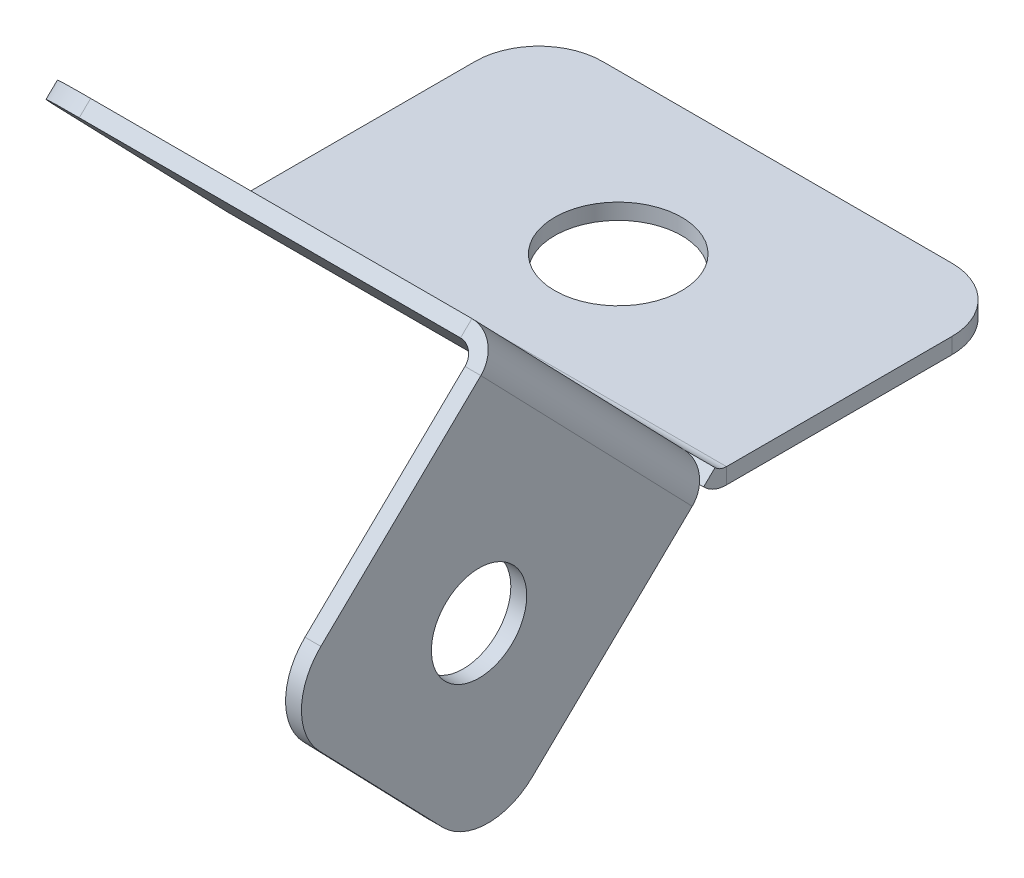
ISO-10303-21;
HEADER;
FILE_DESCRIPTION(('STEP AP214'),'2;1');
FILE_NAME('part.step','',(''),(''),'','','');
FILE_SCHEMA(('AUTOMOTIVE_DESIGN { 1 0 10303 214 1 1 1 1 }'));
ENDSEC;
DATA;
#1=APPLICATION_CONTEXT('core data for automotive mechanical design processes');
#2=APPLICATION_PROTOCOL_DEFINITION('international standard','automotive_design',2000,#1);
#3=PRODUCT_CONTEXT('',#1,'mechanical');
#4=PRODUCT('Part','Part','',(#3));
#5=PRODUCT_RELATED_PRODUCT_CATEGORY('part','',(#4));
#6=PRODUCT_DEFINITION_FORMATION('','',#4);
#7=PRODUCT_DEFINITION_CONTEXT('part definition',#1,'design');
#8=PRODUCT_DEFINITION('design','',#6,#7);
#9=PRODUCT_DEFINITION_SHAPE('','',#8);
#10=(LENGTH_UNIT() NAMED_UNIT(*) SI_UNIT(.MILLI.,.METRE.));
#11=(NAMED_UNIT(*) PLANE_ANGLE_UNIT() SI_UNIT($,.RADIAN.));
#12=(NAMED_UNIT(*) SI_UNIT($,.STERADIAN.) SOLID_ANGLE_UNIT());
#13=UNCERTAINTY_MEASURE_WITH_UNIT(LENGTH_MEASURE(1.E-05),#10,'distance_accuracy_value','');
#14=(GEOMETRIC_REPRESENTATION_CONTEXT(3) GLOBAL_UNCERTAINTY_ASSIGNED_CONTEXT((#13)) GLOBAL_UNIT_ASSIGNED_CONTEXT((#10,
#11,#12)) REPRESENTATION_CONTEXT('',''));
#15=CARTESIAN_POINT('',(0.,0.,0.));
#16=DIRECTION('',(0.,0.,1.));
#17=DIRECTION('',(1.,0.,0.));
#18=AXIS2_PLACEMENT_3D('',#15,#16,#17);
#19=CARTESIAN_POINT('',(6.5,0.305341629540999,4.8120205967255));
#20=DIRECTION('',(0.,0.719339800338647,0.694658370459001));
#21=DIRECTION('',(0.,-0.694658370459001,0.719339800338647));
#22=AXIS2_PLACEMENT_3D('',#19,#20,#21);
#23=PLANE('',#22);
#24=DIRECTION('',(1.,0.,0.));
#25=VECTOR('',#24,1.);
#26=CARTESIAN_POINT('',(-7.5,0.652670814770498,4.45235069655618));
#27=LINE('',#26,#25);
#28=CARTESIAN_POINT('',(6.5,0.652670814770499,4.45235069655618));
#29=VERTEX_POINT('',#28);
#30=CARTESIAN_POINT('',(7.5,0.652670814770501,4.45235069655618));
#31=VERTEX_POINT('',#30);
#32=EDGE_CURVE('E301',#29,#31,#27,.T.);
#33=ORIENTED_EDGE('',*,*,#32,.F.);
#34=CARTESIAN_POINT('',(6.5,-0.0419875556885024,5.17169049689482));
#35=DIRECTION('',(0.,0.719339800338647,0.694658370459001));
#36=DIRECTION('',(0.,-0.694658370459001,0.719339800338647));
#37=AXIS2_PLACEMENT_3D('',#34,#35,#36);
#38=CIRCLE('',#37,1.);
#39=CARTESIAN_POINT('',(7.36602540378444,0.305341629540996,4.8120205967255));
#40=VERTEX_POINT('',#39);
#41=EDGE_CURVE('E267',#29,#40,#38,.F.);
#42=ORIENTED_EDGE('',*,*,#41,.T.);
#43=DIRECTION('',(1.,0.,0.));
#44=VECTOR('',#43,1.);
#45=CARTESIAN_POINT('',(-7.5,0.305341629540998,4.8120205967255));
#46=LINE('',#45,#44);
#47=CARTESIAN_POINT('',(7.5,0.305341629540999,4.8120205967255));
#48=VERTEX_POINT('',#47);
#49=EDGE_CURVE('E290',#48,#40,#46,.F.);
#50=ORIENTED_EDGE('',*,*,#49,.F.);
#51=DIRECTION('',(0.,0.694658370459001,-0.719339800338647));
#52=VECTOR('',#51,1.);
#53=CARTESIAN_POINT('',(7.5,0.652670814770499,4.45235069655618));
#54=LINE('',#53,#52);
#55=EDGE_CURVE('E295',#31,#48,#54,.F.);
#56=ORIENTED_EDGE('',*,*,#55,.F.);
#57=EDGE_LOOP('',(#33,#42,#50,#56));
#58=FACE_BOUND('',#57,.T.);
#59=ADVANCED_FACE('F79',(#58),#23,.T.);
#60=CARTESIAN_POINT('',(0.,-2.60453112695286,2.00198913966243));
#61=DIRECTION('',(0.,0.694658370459001,-0.719339800338647));
#62=DIRECTION('',(0.,0.719339800338647,0.694658370459001));
#63=AXIS2_PLACEMENT_3D('',#60,#61,#62);
#64=PLANE('',#63);
#65=DIRECTION('',(-1.,0.,0.));
#66=VECTOR('',#65,1.);
#67=CARTESIAN_POINT('',(0.,7.19339800338647,11.4637393171865));
#68=LINE('',#67,#66);
#69=CARTESIAN_POINT('',(6.5,7.19339800338648,11.4637393171865));
#70=VERTEX_POINT('',#69);
#71=CARTESIAN_POINT('',(-5.5,7.19339800338647,11.4637393171865));
#72=VERTEX_POINT('',#71);
#73=EDGE_CURVE('E279',#70,#72,#68,.T.);
#74=ORIENTED_EDGE('',*,*,#73,.T.);
#75=CARTESIAN_POINT('',(-5.5,5.75471840270918,10.0744225762685));
#76=DIRECTION('',(0.,0.694658370459001,-0.719339800338647));
#77=DIRECTION('',(0.,0.719339800338647,0.694658370459001));
#78=AXIS2_PLACEMENT_3D('',#75,#76,#77);
#79=CIRCLE('',#78,2.);
#80=CARTESIAN_POINT('',(-7.5,5.75471840270918,10.0744225762685));
#81=VERTEX_POINT('',#80);
#82=EDGE_CURVE('E374',#72,#81,#79,.F.);
#83=ORIENTED_EDGE('',*,*,#82,.T.);
#84=DIRECTION('',(0.,-0.719339800338647,-0.694658370459001));
#85=VECTOR('',#84,1.);
#86=CARTESIAN_POINT('',(-7.5,-2.60453112695286,2.00198913966243));
#87=LINE('',#86,#85);
#88=CARTESIAN_POINT('',(-7.5,0.305341629540997,4.8120205967255));
#89=VERTEX_POINT('',#88);
#90=EDGE_CURVE('E283',#81,#89,#87,.T.);
#91=ORIENTED_EDGE('',*,*,#90,.T.);
#92=CARTESIAN_POINT('',(6.5,0.305341629540998,4.8120205967255));
#93=VERTEX_POINT('',#92);
#94=EDGE_CURVE('E294',#93,#89,#46,.F.);
#95=ORIENTED_EDGE('',*,*,#94,.F.);
#96=DIRECTION('',(0.,0.719339800338647,0.694658370459001));
#97=VECTOR('',#96,1.);
#98=CARTESIAN_POINT('',(6.5,7.19339800338648,11.4637393171865));
#99=LINE('',#98,#97);
#100=EDGE_CURVE('E273',#70,#93,#99,.F.);
#101=ORIENTED_EDGE('',*,*,#100,.F.);
#102=EDGE_LOOP('',(#74,#83,#91,#95,#101));
#103=FACE_BOUND('',#102,.T.);
#104=ADVANCED_FACE('F435',(#103),#64,.F.);
#105=CARTESIAN_POINT('',(0.,-2.25720194172336,1.64231923949311));
#106=DIRECTION('',(0.,0.694658370459001,-0.719339800338647));
#107=DIRECTION('',(0.,0.719339800338647,0.694658370459001));
#108=AXIS2_PLACEMENT_3D('',#105,#106,#107);
#109=PLANE('',#108);
#110=DIRECTION('',(0.,0.719339800338647,0.694658370459001));
#111=VECTOR('',#110,1.);
#112=CARTESIAN_POINT('',(-7.5,0.499999999999999,4.30491820449166));
#113=LINE('',#112,#111);
#114=CARTESIAN_POINT('',(-7.5,6.10204758793868,9.71475267609915));
#115=VERTEX_POINT('',#114);
#116=CARTESIAN_POINT('',(-7.5,0.652670814770498,4.45235069655618));
#117=VERTEX_POINT('',#116);
#118=EDGE_CURVE('E288',#115,#117,#113,.F.);
#119=ORIENTED_EDGE('',*,*,#118,.F.);
#120=CARTESIAN_POINT('',(-5.5,6.10204758793868,9.71475267609915));
#121=DIRECTION('',(0.,0.694658370459001,-0.719339800338647));
#122=DIRECTION('',(0.,0.719339800338647,0.694658370459001));
#123=AXIS2_PLACEMENT_3D('',#120,#121,#122);
#124=CIRCLE('',#123,2.);
#125=CARTESIAN_POINT('',(-5.5,7.54072718861597,11.1040694170171));
#126=VERTEX_POINT('',#125);
#127=EDGE_CURVE('E370',#115,#126,#124,.T.);
#128=ORIENTED_EDGE('',*,*,#127,.T.);
#129=DIRECTION('',(1.,0.,0.));
#130=VECTOR('',#129,1.);
#131=CARTESIAN_POINT('',(-7.5,7.54072718861597,11.1040694170171));
#132=LINE('',#131,#130);
#133=CARTESIAN_POINT('',(6.5,7.54072718861598,11.1040694170172));
#134=VERTEX_POINT('',#133);
#135=EDGE_CURVE('E285',#134,#126,#132,.F.);
#136=ORIENTED_EDGE('',*,*,#135,.F.);
#137=DIRECTION('',(0.,0.719339800338647,0.694658370459001));
#138=VECTOR('',#137,1.);
#139=CARTESIAN_POINT('',(6.5,7.54072718861598,11.1040694170172));
#140=LINE('',#139,#138);
#141=EDGE_CURVE('E218',#134,#29,#140,.F.);
#142=ORIENTED_EDGE('',*,*,#141,.T.);
#143=EDGE_CURVE('E298',#117,#29,#27,.T.);
#144=ORIENTED_EDGE('',*,*,#143,.F.);
#145=EDGE_LOOP('',(#119,#128,#136,#142,#144));
#146=FACE_BOUND('',#145,.T.);
#147=ADVANCED_FACE('F415',(#146),#109,.T.);
#148=CARTESIAN_POINT('',(-7.5,7.19339800338647,11.4637393171865));
#149=DIRECTION('',(0.,-0.719339800338647,-0.694658370459001));
#150=DIRECTION('',(0.,0.694658370459001,-0.719339800338647));
#151=AXIS2_PLACEMENT_3D('',#148,#149,#150);
#152=PLANE('',#151);
#153=ORIENTED_EDGE('',*,*,#135,.T.);
#154=DIRECTION('',(0.,0.694658370459001,-0.719339800338647));
#155=VECTOR('',#154,1.);
#156=CARTESIAN_POINT('',(-5.5,7.19339800338647,11.4637393171865));
#157=LINE('',#156,#155);
#158=EDGE_CURVE('E372',#126,#72,#157,.F.);
#159=ORIENTED_EDGE('',*,*,#158,.T.);
#160=ORIENTED_EDGE('',*,*,#73,.F.);
#161=DIRECTION('',(0.,0.694658370459001,-0.719339800338647));
#162=VECTOR('',#161,1.);
#163=CARTESIAN_POINT('',(6.5,7.19339800338648,11.4637393171865));
#164=LINE('',#163,#162);
#165=EDGE_CURVE('E269',#70,#134,#164,.T.);
#166=ORIENTED_EDGE('',*,*,#165,.T.);
#167=EDGE_LOOP('',(#153,#159,#160,#166));
#168=FACE_BOUND('',#167,.T.);
#169=ADVANCED_FACE('F442',(#168),#152,.F.);
#170=CARTESIAN_POINT('',(7.5,0.5,-5.));
#171=DIRECTION('',(1.,0.,0.));
#172=DIRECTION('',(0.,0.,-1.));
#173=AXIS2_PLACEMENT_3D('',#170,#171,#172);
#174=PLANE('',#173);
#175=DIRECTION('',(0.,0.,1.));
#176=VECTOR('',#175,1.);
#177=CARTESIAN_POINT('',(7.5,0.,0.));
#178=LINE('',#177,#176);
#179=CARTESIAN_POINT('',(7.5,0.,4.09268079638686));
#180=VERTEX_POINT('',#179);
#181=CARTESIAN_POINT('',(7.5,0.,-3.));
#182=VERTEX_POINT('',#181);
#183=EDGE_CURVE('E325',#180,#182,#178,.F.);
#184=ORIENTED_EDGE('',*,*,#183,.T.);
#185=DIRECTION('',(0.,1.,0.));
#186=VECTOR('',#185,1.);
#187=CARTESIAN_POINT('',(7.5,0.5,-3.));
#188=LINE('',#187,#186);
#189=CARTESIAN_POINT('',(7.5,0.5,-3.));
#190=VERTEX_POINT('',#189);
#191=EDGE_CURVE('E13',#182,#190,#188,.T.);
#192=ORIENTED_EDGE('',*,*,#191,.T.);
#193=DIRECTION('',(0.,0.,-1.));
#194=VECTOR('',#193,1.);
#195=CARTESIAN_POINT('',(7.5,0.5,-5.));
#196=LINE('',#195,#194);
#197=CARTESIAN_POINT('',(7.5,0.5,4.09268079638686));
#198=VERTEX_POINT('',#197);
#199=EDGE_CURVE('E327',#198,#190,#196,.T.);
#200=ORIENTED_EDGE('',*,*,#199,.F.);
#201=DIRECTION('',(0.,-1.,0.));
#202=VECTOR('',#201,1.);
#203=CARTESIAN_POINT('',(7.5,0.500000000000002,4.09268079638686));
#204=LINE('',#203,#202);
#205=EDGE_CURVE('E311',#198,#180,#204,.T.);
#206=ORIENTED_EDGE('',*,*,#205,.T.);
#207=EDGE_LOOP('',(#184,#192,#200,#206));
#208=FACE_BOUND('',#207,.T.);
#209=ADVANCED_FACE('F425',(#208),#174,.T.);
#210=CARTESIAN_POINT('',(0.,0.5,0.));
#211=DIRECTION('',(0.,1.,0.));
#212=DIRECTION('',(0.,0.,1.));
#213=AXIS2_PLACEMENT_3D('',#210,#211,#212);
#214=PLANE('',#213);
#215=CARTESIAN_POINT('',(0.,0.5,0.));
#216=DIRECTION('',(0.,1.,0.));
#217=DIRECTION('',(0.,0.,1.));
#218=AXIS2_PLACEMENT_3D('',#215,#216,#217);
#219=CIRCLE('',#218,2.);
#220=CARTESIAN_POINT('',(0.,0.5,2.));
#221=VERTEX_POINT('',#220);
#222=EDGE_CURVE('E336',#221,#221,#219,.T.);
#223=ORIENTED_EDGE('',*,*,#222,.F.);
#224=EDGE_LOOP('',(#223));
#225=FACE_BOUND('',#224,.T.);
#226=DIRECTION('',(-1.,0.,0.));
#227=VECTOR('',#226,1.);
#228=CARTESIAN_POINT('',(-7.5,0.5,-5.));
#229=LINE('',#228,#227);
#230=CARTESIAN_POINT('',(5.49999999999999,0.5,-5.));
#231=VERTEX_POINT('',#230);
#232=CARTESIAN_POINT('',(-5.5,0.5,-5.));
#233=VERTEX_POINT('',#232);
#234=EDGE_CURVE('E330',#231,#233,#229,.T.);
#235=ORIENTED_EDGE('',*,*,#234,.T.);
#236=CARTESIAN_POINT('',(-5.5,0.5,-3.));
#237=DIRECTION('',(0.,1.,0.));
#238=DIRECTION('',(0.,0.,1.));
#239=AXIS2_PLACEMENT_3D('',#236,#237,#238);
#240=CIRCLE('',#239,2.);
#241=CARTESIAN_POINT('',(-7.5,0.5,-3.));
#242=VERTEX_POINT('',#241);
#243=EDGE_CURVE('E383',#233,#242,#240,.T.);
#244=ORIENTED_EDGE('',*,*,#243,.T.);
#245=DIRECTION('',(0.,0.,1.));
#246=VECTOR('',#245,1.);
#247=CARTESIAN_POINT('',(-7.5,0.5,-5.));
#248=LINE('',#247,#246);
#249=CARTESIAN_POINT('',(-7.5,0.5,4.09268079638686));
#250=VERTEX_POINT('',#249);
#251=EDGE_CURVE('E334',#242,#250,#248,.T.);
#252=ORIENTED_EDGE('',*,*,#251,.T.);
#253=DIRECTION('',(1.,0.,0.));
#254=VECTOR('',#253,1.);
#255=CARTESIAN_POINT('',(7.5,0.500000000000002,4.09268079638686));
#256=LINE('',#255,#254);
#257=EDGE_CURVE('E317',#198,#250,#256,.F.);
#258=ORIENTED_EDGE('',*,*,#257,.F.);
#259=ORIENTED_EDGE('',*,*,#199,.T.);
#260=CARTESIAN_POINT('',(5.5,0.5,-3.));
#261=DIRECTION('',(0.,1.,0.));
#262=DIRECTION('',(0.,0.,1.));
#263=AXIS2_PLACEMENT_3D('',#260,#261,#262);
#264=CIRCLE('',#263,2.);
#265=EDGE_CURVE('E381',#190,#231,#264,.T.);
#266=ORIENTED_EDGE('',*,*,#265,.T.);
#267=EDGE_LOOP('',(#235,#244,#252,#258,#259,#266));
#268=FACE_BOUND('',#267,.T.);
#269=ADVANCED_FACE('F396',(#225,#268),#214,.T.);
#270=CARTESIAN_POINT('',(0.,0.,0.));
#271=DIRECTION('',(0.,1.,0.));
#272=DIRECTION('',(0.,0.,1.));
#273=AXIS2_PLACEMENT_3D('',#270,#271,#272);
#274=PLANE('',#273);
#275=CARTESIAN_POINT('',(0.,0.,0.));
#276=DIRECTION('',(0.,1.,0.));
#277=DIRECTION('',(0.,0.,1.));
#278=AXIS2_PLACEMENT_3D('',#275,#276,#277);
#279=CIRCLE('',#278,2.);
#280=CARTESIAN_POINT('',(0.,0.,2.));
#281=VERTEX_POINT('',#280);
#282=EDGE_CURVE('E331',#281,#281,#279,.T.);
#283=ORIENTED_EDGE('',*,*,#282,.T.);
#284=EDGE_LOOP('',(#283));
#285=FACE_BOUND('',#284,.T.);
#286=DIRECTION('',(0.,0.,1.));
#287=VECTOR('',#286,1.);
#288=CARTESIAN_POINT('',(-7.5,0.,0.));
#289=LINE('',#288,#287);
#290=CARTESIAN_POINT('',(-7.5,0.,-3.));
#291=VERTEX_POINT('',#290);
#292=CARTESIAN_POINT('',(-7.5,0.,4.09268079638686));
#293=VERTEX_POINT('',#292);
#294=EDGE_CURVE('E342',#291,#293,#289,.T.);
#295=ORIENTED_EDGE('',*,*,#294,.F.);
#296=CARTESIAN_POINT('',(-5.5,0.,-3.));
#297=DIRECTION('',(0.,1.,0.));
#298=DIRECTION('',(0.,0.,1.));
#299=AXIS2_PLACEMENT_3D('',#296,#297,#298);
#300=CIRCLE('',#299,2.);
#301=CARTESIAN_POINT('',(-5.5,0.,-5.));
#302=VERTEX_POINT('',#301);
#303=EDGE_CURVE('E87',#291,#302,#300,.F.);
#304=ORIENTED_EDGE('',*,*,#303,.T.);
#305=DIRECTION('',(1.,0.,0.));
#306=VECTOR('',#305,1.);
#307=CARTESIAN_POINT('',(0.,0.,-5.));
#308=LINE('',#307,#306);
#309=CARTESIAN_POINT('',(5.5,0.,-5.));
#310=VERTEX_POINT('',#309);
#311=EDGE_CURVE('E341',#310,#302,#308,.F.);
#312=ORIENTED_EDGE('',*,*,#311,.F.);
#313=CARTESIAN_POINT('',(5.5,0.,-3.));
#314=DIRECTION('',(0.,1.,0.));
#315=DIRECTION('',(0.,0.,1.));
#316=AXIS2_PLACEMENT_3D('',#313,#314,#315);
#317=CIRCLE('',#316,2.);
#318=EDGE_CURVE('E94',#310,#182,#317,.F.);
#319=ORIENTED_EDGE('',*,*,#318,.T.);
#320=ORIENTED_EDGE('',*,*,#183,.F.);
#321=DIRECTION('',(1.,0.,0.));
#322=VECTOR('',#321,1.);
#323=CARTESIAN_POINT('',(7.5,0.,4.09268079638686));
#324=LINE('',#323,#322);
#325=EDGE_CURVE('E304',#180,#293,#324,.F.);
#326=ORIENTED_EDGE('',*,*,#325,.T.);
#327=EDGE_LOOP('',(#295,#304,#312,#319,#320,#326));
#328=FACE_BOUND('',#327,.T.);
#329=ADVANCED_FACE('F387',(#285,#328),#274,.F.);
#330=CARTESIAN_POINT('',(-7.5,0.5,-5.));
#331=DIRECTION('',(-1.,0.,0.));
#332=DIRECTION('',(0.,0.,1.));
#333=AXIS2_PLACEMENT_3D('',#330,#331,#332);
#334=PLANE('',#333);
#335=ORIENTED_EDGE('',*,*,#251,.F.);
#336=DIRECTION('',(0.,1.,0.));
#337=VECTOR('',#336,1.);
#338=CARTESIAN_POINT('',(-7.5,0.5,-3.));
#339=LINE('',#338,#337);
#340=EDGE_CURVE('E102',#242,#291,#339,.F.);
#341=ORIENTED_EDGE('',*,*,#340,.T.);
#342=ORIENTED_EDGE('',*,*,#294,.T.);
#343=DIRECTION('',(0.,-1.,0.));
#344=VECTOR('',#343,1.);
#345=CARTESIAN_POINT('',(-7.5,0.499999999999999,4.09268079638686));
#346=LINE('',#345,#344);
#347=EDGE_CURVE('E322',#250,#293,#346,.T.);
#348=ORIENTED_EDGE('',*,*,#347,.F.);
#349=EDGE_LOOP('',(#335,#341,#342,#348));
#350=FACE_BOUND('',#349,.T.);
#351=ADVANCED_FACE('F398',(#350),#334,.T.);
#352=CARTESIAN_POINT('',(-7.5,0.5,-5.));
#353=DIRECTION('',(0.,0.,-1.));
#354=DIRECTION('',(-1.,0.,0.));
#355=AXIS2_PLACEMENT_3D('',#352,#353,#354);
#356=PLANE('',#355);
#357=ORIENTED_EDGE('',*,*,#311,.T.);
#358=DIRECTION('',(0.,1.,0.));
#359=VECTOR('',#358,1.);
#360=CARTESIAN_POINT('',(-5.5,0.5,-5.));
#361=LINE('',#360,#359);
#362=EDGE_CURVE('E378',#302,#233,#361,.T.);
#363=ORIENTED_EDGE('',*,*,#362,.T.);
#364=ORIENTED_EDGE('',*,*,#234,.F.);
#365=DIRECTION('',(0.,1.,0.));
#366=VECTOR('',#365,1.);
#367=CARTESIAN_POINT('',(5.5,0.5,-5.));
#368=LINE('',#367,#366);
#369=EDGE_CURVE('E376',#231,#310,#368,.F.);
#370=ORIENTED_EDGE('',*,*,#369,.T.);
#371=EDGE_LOOP('',(#357,#363,#364,#370));
#372=FACE_BOUND('',#371,.T.);
#373=ADVANCED_FACE('F391',(#372),#356,.T.);
#374=CARTESIAN_POINT('',(0.,0.5,0.));
#375=DIRECTION('',(0.,1.,0.));
#376=DIRECTION('',(0.,0.,1.));
#377=AXIS2_PLACEMENT_3D('',#374,#375,#376);
#378=CYLINDRICAL_SURFACE('',#377,2.);
#379=ORIENTED_EDGE('',*,*,#222,.T.);
#380=EDGE_LOOP('',(#379));
#381=FACE_BOUND('',#380,.T.);
#382=ORIENTED_EDGE('',*,*,#282,.F.);
#383=EDGE_LOOP('',(#382));
#384=FACE_BOUND('',#383,.T.);
#385=ADVANCED_FACE('F493',(#381,#384),#378,.F.);
#386=CARTESIAN_POINT('',(-7.5,0.999999999999998,4.09268079638686));
#387=DIRECTION('',(-1.,0.,0.));
#388=DIRECTION('',(0.,-1.,0.));
#389=AXIS2_PLACEMENT_3D('',#386,#387,#388);
#390=PLANE('',#389);
#391=DIRECTION('',(0.,0.694658370459001,-0.719339800338647));
#392=VECTOR('',#391,1.);
#393=CARTESIAN_POINT('',(-7.5,0.305341629540998,4.8120205967255));
#394=LINE('',#393,#392);
#395=EDGE_CURVE('E278',#117,#89,#394,.F.);
#396=ORIENTED_EDGE('',*,*,#395,.F.);
#397=CARTESIAN_POINT('',(-7.5,0.999999999999998,4.09268079638686));
#398=DIRECTION('',(1.,0.,0.));
#399=DIRECTION('',(0.,1.,0.));
#400=AXIS2_PLACEMENT_3D('',#397,#398,#399);
#401=CIRCLE('',#400,0.499999999999999);
#402=EDGE_CURVE('E314',#250,#117,#401,.F.);
#403=ORIENTED_EDGE('',*,*,#402,.F.);
#404=ORIENTED_EDGE('',*,*,#347,.T.);
#405=CARTESIAN_POINT('',(-7.5,0.999999999999998,4.09268079638686));
#406=DIRECTION('',(1.,0.,0.));
#407=DIRECTION('',(0.,1.,0.));
#408=AXIS2_PLACEMENT_3D('',#405,#406,#407);
#409=CIRCLE('',#408,0.999999999999999);
#410=EDGE_CURVE('E307',#293,#89,#409,.F.);
#411=ORIENTED_EDGE('',*,*,#410,.T.);
#412=EDGE_LOOP('',(#396,#403,#404,#411));
#413=FACE_BOUND('',#412,.T.);
#414=ADVANCED_FACE('F408',(#413),#390,.T.);
#415=CARTESIAN_POINT('',(7.5,1.,4.09268079638686));
#416=DIRECTION('',(-1.,0.,0.));
#417=DIRECTION('',(0.,-1.,0.));
#418=AXIS2_PLACEMENT_3D('',#415,#416,#417);
#419=PLANE('',#418);
#420=CARTESIAN_POINT('',(7.5,1.,4.09268079638686));
#421=DIRECTION('',(1.,0.,0.));
#422=DIRECTION('',(0.,1.,0.));
#423=AXIS2_PLACEMENT_3D('',#420,#421,#422);
#424=CIRCLE('',#423,0.499999999999999);
#425=EDGE_CURVE('E282',#31,#198,#424,.T.);
#426=ORIENTED_EDGE('',*,*,#425,.F.);
#427=ORIENTED_EDGE('',*,*,#55,.T.);
#428=CARTESIAN_POINT('',(7.5,1.,4.09268079638686));
#429=DIRECTION('',(1.,0.,0.));
#430=DIRECTION('',(0.,1.,0.));
#431=AXIS2_PLACEMENT_3D('',#428,#429,#430);
#432=CIRCLE('',#431,0.999999999999999);
#433=EDGE_CURVE('E308',#48,#180,#432,.T.);
#434=ORIENTED_EDGE('',*,*,#433,.T.);
#435=ORIENTED_EDGE('',*,*,#205,.F.);
#436=EDGE_LOOP('',(#426,#427,#434,#435));
#437=FACE_BOUND('',#436,.T.);
#438=ADVANCED_FACE('F422',(#437),#419,.F.);
#439=CARTESIAN_POINT('',(7.5,1.,4.09268079638686));
#440=DIRECTION('',(1.,0.,0.));
#441=DIRECTION('',(0.,-0.694658370459001,0.719339800338647));
#442=AXIS2_PLACEMENT_3D('',#439,#440,#441);
#443=CYLINDRICAL_SURFACE('',#442,0.999999999999999);
#444=ORIENTED_EDGE('',*,*,#325,.F.);
#445=ORIENTED_EDGE('',*,*,#433,.F.);
#446=ORIENTED_EDGE('',*,*,#49,.T.);
#447=EDGE_CURVE('E293',#40,#93,#46,.F.);
#448=ORIENTED_EDGE('',*,*,#447,.T.);
#449=ORIENTED_EDGE('',*,*,#94,.T.);
#450=ORIENTED_EDGE('',*,*,#410,.F.);
#451=EDGE_LOOP('',(#444,#445,#446,#448,#449,#450));
#452=FACE_BOUND('',#451,.T.);
#453=ADVANCED_FACE('F429',(#452),#443,.T.);
#454=CARTESIAN_POINT('',(7.5,1.,4.09268079638686));
#455=DIRECTION('',(1.,0.,0.));
#456=DIRECTION('',(0.,-0.694658370459001,0.719339800338647));
#457=AXIS2_PLACEMENT_3D('',#454,#455,#456);
#458=CYLINDRICAL_SURFACE('',#457,0.499999999999999);
#459=ORIENTED_EDGE('',*,*,#257,.T.);
#460=ORIENTED_EDGE('',*,*,#402,.T.);
#461=ORIENTED_EDGE('',*,*,#143,.T.);
#462=ORIENTED_EDGE('',*,*,#32,.T.);
#463=ORIENTED_EDGE('',*,*,#425,.T.);
#464=EDGE_LOOP('',(#459,#460,#461,#462,#463));
#465=FACE_BOUND('',#464,.T.);
#466=ADVANCED_FACE('F403',(#465),#458,.F.);
#467=CARTESIAN_POINT('',(-7.5,0.152670814770499,4.66458810466098));
#468=DIRECTION('',(1.,0.,0.));
#469=DIRECTION('',(0.,1.,0.));
#470=AXIS2_PLACEMENT_3D('',#467,#468,#469);
#471=PLANE('',#470);
#472=ORIENTED_EDGE('',*,*,#90,.F.);
#473=DIRECTION('',(0.,0.694658370459001,-0.719339800338647));
#474=VECTOR('',#473,1.);
#475=CARTESIAN_POINT('',(-7.5,5.75471840270918,10.0744225762685));
#476=LINE('',#475,#474);
#477=EDGE_CURVE('E367',#81,#115,#476,.T.);
#478=ORIENTED_EDGE('',*,*,#477,.T.);
#479=ORIENTED_EDGE('',*,*,#118,.T.);
#480=ORIENTED_EDGE('',*,*,#395,.T.);
#481=EDGE_LOOP('',(#472,#478,#479,#480));
#482=FACE_BOUND('',#481,.T.);
#483=ADVANCED_FACE('F411',(#482),#471,.F.);
#484=CARTESIAN_POINT('',(6.5,-0.0419875556885007,5.17169049689483));
#485=DIRECTION('',(0.,-0.719339800338647,-0.694658370459001));
#486=DIRECTION('',(0.,0.694658370459001,-0.719339800338647));
#487=AXIS2_PLACEMENT_3D('',#484,#485,#486);
#488=PLANE('',#487);
#489=ORIENTED_EDGE('',*,*,#447,.F.);
#490=CARTESIAN_POINT('',(7.5,-0.0419875556885,5.17169049689482));
#491=VERTEX_POINT('',#490);
#492=EDGE_CURVE('E266',#40,#491,#38,.F.);
#493=ORIENTED_EDGE('',*,*,#492,.T.);
#494=DIRECTION('',(-1.,0.,0.));
#495=VECTOR('',#494,1.);
#496=CARTESIAN_POINT('',(7.5,-0.041987555688497,5.17169049689482));
#497=LINE('',#496,#495);
#498=CARTESIAN_POINT('',(7.,-0.0419875556884998,5.17169049689482));
#499=VERTEX_POINT('',#498);
#500=EDGE_CURVE('E262',#499,#491,#497,.F.);
#501=ORIENTED_EDGE('',*,*,#500,.F.);
#502=CARTESIAN_POINT('',(6.5,-0.0419875556885007,5.17169049689483));
#503=DIRECTION('',(0.,0.719339800338647,0.694658370459001));
#504=DIRECTION('',(0.,-0.694658370459001,0.719339800338647));
#505=AXIS2_PLACEMENT_3D('',#502,#503,#504);
#506=CIRCLE('',#505,0.5);
#507=EDGE_CURVE('E221',#93,#499,#506,.F.);
#508=ORIENTED_EDGE('',*,*,#507,.F.);
#509=EDGE_LOOP('',(#489,#493,#501,#508));
#510=FACE_BOUND('',#509,.T.);
#511=ADVANCED_FACE('F465',(#510),#488,.T.);
#512=CARTESIAN_POINT('',(6.5,6.84606881815698,11.8234092173558));
#513=DIRECTION('',(0.,-0.719339800338647,-0.694658370459001));
#514=DIRECTION('',(0.,0.694658370459001,-0.719339800338647));
#515=AXIS2_PLACEMENT_3D('',#512,#513,#514);
#516=PLANE('',#515);
#517=CARTESIAN_POINT('',(6.5,6.84606881815698,11.8234092173558));
#518=DIRECTION('',(0.,0.719339800338647,0.694658370459001));
#519=DIRECTION('',(0.,-0.694658370459001,0.719339800338647));
#520=AXIS2_PLACEMENT_3D('',#517,#518,#519);
#521=CIRCLE('',#520,0.5);
#522=CARTESIAN_POINT('',(7.,6.84606881815698,11.8234092173558));
#523=VERTEX_POINT('',#522);
#524=EDGE_CURVE('E228',#523,#70,#521,.T.);
#525=ORIENTED_EDGE('',*,*,#524,.F.);
#526=DIRECTION('',(-1.,0.,0.));
#527=VECTOR('',#526,1.);
#528=CARTESIAN_POINT('',(7.,6.84606881815698,11.8234092173558));
#529=LINE('',#528,#527);
#530=CARTESIAN_POINT('',(7.5,6.84606881815698,11.8234092173558));
#531=VERTEX_POINT('',#530);
#532=EDGE_CURVE('E225',#523,#531,#529,.F.);
#533=ORIENTED_EDGE('',*,*,#532,.T.);
#534=CARTESIAN_POINT('',(6.5,6.84606881815698,11.8234092173558));
#535=DIRECTION('',(0.,0.719339800338647,0.694658370459001));
#536=DIRECTION('',(0.,-0.694658370459001,0.719339800338647));
#537=AXIS2_PLACEMENT_3D('',#534,#535,#536);
#538=CIRCLE('',#537,1.);
#539=EDGE_CURVE('E210',#531,#134,#538,.T.);
#540=ORIENTED_EDGE('',*,*,#539,.T.);
#541=ORIENTED_EDGE('',*,*,#165,.F.);
#542=EDGE_LOOP('',(#525,#533,#540,#541));
#543=FACE_BOUND('',#542,.T.);
#544=ADVANCED_FACE('F226',(#543),#516,.F.);
#545=CARTESIAN_POINT('',(6.5,6.84606881815698,11.8234092173558));
#546=DIRECTION('',(0.,0.719339800338647,0.694658370459001));
#547=DIRECTION('',(1.,0.,0.));
#548=AXIS2_PLACEMENT_3D('',#545,#546,#547);
#549=CYLINDRICAL_SURFACE('',#548,1.);
#550=ORIENTED_EDGE('',*,*,#141,.F.);
#551=ORIENTED_EDGE('',*,*,#539,.F.);
#552=DIRECTION('',(0.,0.719339800338647,0.694658370459001));
#553=VECTOR('',#552,1.);
#554=CARTESIAN_POINT('',(7.5,-0.0419875556884975,5.17169049689482));
#555=LINE('',#554,#553);
#556=EDGE_CURVE('E215',#531,#491,#555,.F.);
#557=ORIENTED_EDGE('',*,*,#556,.T.);
#558=ORIENTED_EDGE('',*,*,#492,.F.);
#559=ORIENTED_EDGE('',*,*,#41,.F.);
#560=EDGE_LOOP('',(#550,#551,#557,#558,#559));
#561=FACE_BOUND('',#560,.T.);
#562=ADVANCED_FACE('F212',(#561),#549,.T.);
#563=CARTESIAN_POINT('',(6.5,6.84606881815698,11.8234092173558));
#564=DIRECTION('',(0.,0.719339800338647,0.694658370459001));
#565=DIRECTION('',(1.,0.,0.));
#566=AXIS2_PLACEMENT_3D('',#563,#564,#565);
#567=CYLINDRICAL_SURFACE('',#566,0.5);
#568=ORIENTED_EDGE('',*,*,#100,.T.);
#569=ORIENTED_EDGE('',*,*,#507,.T.);
#570=DIRECTION('',(0.,0.719339800338647,0.694658370459001));
#571=VECTOR('',#570,1.);
#572=CARTESIAN_POINT('',(7.,-0.0419875556884987,5.17169049689483));
#573=LINE('',#572,#571);
#574=EDGE_CURVE('E233',#499,#523,#573,.T.);
#575=ORIENTED_EDGE('',*,*,#574,.T.);
#576=ORIENTED_EDGE('',*,*,#524,.T.);
#577=EDGE_LOOP('',(#568,#569,#575,#576));
#578=FACE_BOUND('',#577,.T.);
#579=ADVANCED_FACE('F444',(#578),#567,.F.);
#580=CARTESIAN_POINT('',(7.5,0.305341629541001,4.8120205967255));
#581=DIRECTION('',(0.,0.719339800338647,0.694658370459001));
#582=DIRECTION('',(0.,-0.694658370459001,0.719339800338647));
#583=AXIS2_PLACEMENT_3D('',#580,#581,#582);
#584=PLANE('',#583);
#585=DIRECTION('',(0.,0.694658370459001,-0.719339800338647));
#586=VECTOR('',#585,1.);
#587=CARTESIAN_POINT('',(7.49999999999999,2.56254357126438,2.47461956172403));
#588=LINE('',#587,#586);
#589=CARTESIAN_POINT('',(7.50000000000002,-4.90459614890151,10.2070690992654));
#590=VERTEX_POINT('',#589);
#591=EDGE_CURVE('E242',#590,#491,#588,.T.);
#592=ORIENTED_EDGE('',*,*,#591,.F.);
#593=DIRECTION('',(-1.,0.,0.));
#594=VECTOR('',#593,1.);
#595=CARTESIAN_POINT('',(7.50000000000002,-4.90459614890151,10.2070690992654));
#596=LINE('',#595,#594);
#597=CARTESIAN_POINT('',(7.00000000000002,-4.90459614890151,10.2070690992654));
#598=VERTEX_POINT('',#597);
#599=EDGE_CURVE('E339',#590,#598,#596,.T.);
#600=ORIENTED_EDGE('',*,*,#599,.T.);
#601=DIRECTION('',(0.,-0.694658370459001,0.719339800338647));
#602=VECTOR('',#601,1.);
#603=CARTESIAN_POINT('',(7.,0.305341629541,4.8120205967255));
#604=LINE('',#603,#602);
#605=EDGE_CURVE('E244',#598,#499,#604,.F.);
#606=ORIENTED_EDGE('',*,*,#605,.T.);
#607=ORIENTED_EDGE('',*,*,#500,.T.);
#608=EDGE_LOOP('',(#592,#600,#606,#607));
#609=FACE_BOUND('',#608,.T.);
#610=ADVANCED_FACE('F462',(#609),#584,.F.);
#611=CARTESIAN_POINT('',(7.50000000000003,0.594143484025964,18.2974674204036));
#612=DIRECTION('',(0.,-0.719339800338647,-0.694658370459001));
#613=DIRECTION('',(0.,0.694658370459001,-0.719339800338647));
#614=AXIS2_PLACEMENT_3D('',#611,#612,#613);
#615=PLANE('',#614);
#616=DIRECTION('',(0.,0.694658370459001,-0.719339800338647));
#617=VECTOR('',#616,1.);
#618=CARTESIAN_POINT('',(7.00000000000003,0.594143484025963,18.2974674204036));
#619=LINE('',#618,#617);
#620=CARTESIAN_POINT('',(7.00000000000002,1.98346022494397,16.8587878197263));
#621=VERTEX_POINT('',#620);
#622=EDGE_CURVE('E258',#523,#621,#619,.F.);
#623=ORIENTED_EDGE('',*,*,#622,.T.);
#624=DIRECTION('',(-1.,0.,0.));
#625=VECTOR('',#624,1.);
#626=CARTESIAN_POINT('',(7.50000000000002,1.98346022494397,16.8587878197263));
#627=LINE('',#626,#625);
#628=CARTESIAN_POINT('',(7.50000000000002,1.98346022494397,16.8587878197263));
#629=VERTEX_POINT('',#628);
#630=EDGE_CURVE('E248',#621,#629,#627,.F.);
#631=ORIENTED_EDGE('',*,*,#630,.T.);
#632=DIRECTION('',(0.,-0.694658370459001,0.719339800338647));
#633=VECTOR('',#632,1.);
#634=CARTESIAN_POINT('',(7.49999999999999,9.45059994510986,9.12633828218501));
#635=LINE('',#634,#633);
#636=EDGE_CURVE('E239',#531,#629,#635,.T.);
#637=ORIENTED_EDGE('',*,*,#636,.F.);
#638=ORIENTED_EDGE('',*,*,#532,.F.);
#639=EDGE_LOOP('',(#623,#631,#637,#638));
#640=FACE_BOUND('',#639,.T.);
#641=ADVANCED_FACE('F246',(#640),#615,.F.);
#642=CARTESIAN_POINT('',(7.49999999999999,0.,0.));
#643=DIRECTION('',(-1.,0.,0.));
#644=DIRECTION('',(0.,0.,1.));
#645=AXIS2_PLACEMENT_3D('',#642,#643,#644);
#646=PLANE('',#645);
#647=CARTESIAN_POINT('',(7.50000000000002,0.128518840895739,11.8799950763422));
#648=DIRECTION('',(1.,0.,0.));
#649=DIRECTION('',(0.,0.,-1.));
#650=AXIS2_PLACEMENT_3D('',#647,#648,#649);
#651=CIRCLE('',#650,1.5);
#652=CARTESIAN_POINT('',(7.50000000000001,0.128518840895739,10.3799950763422));
#653=VERTEX_POINT('',#652);
#654=EDGE_CURVE('E350',#653,#653,#651,.T.);
#655=ORIENTED_EDGE('',*,*,#654,.F.);
#656=EDGE_LOOP('',(#655));
#657=FACE_BOUND('',#656,.T.);
#658=DIRECTION('',(0.,-0.719339800338648,-0.694658370459001));
#659=VECTOR('',#658,1.);
#660=CARTESIAN_POINT('',(7.50000000000003,-8.85645646108388,9.1711291382186));
#661=LINE('',#660,#659);
#662=CARTESIAN_POINT('',(7.50000000000003,-0.844536116651327,16.9081506794856));
#663=VERTEX_POINT('',#662);
#664=CARTESIAN_POINT('',(7.50000000000003,-4.85523328914222,13.0350654408607));
#665=VERTEX_POINT('',#664);
#666=EDGE_CURVE('E249',#663,#665,#661,.T.);
#667=ORIENTED_EDGE('',*,*,#666,.T.);
#668=CARTESIAN_POINT('',(7.50000000000002,-3.46591654822421,11.5963858401834));
#669=DIRECTION('',(-1.,0.,0.));
#670=DIRECTION('',(0.,0.,1.));
#671=AXIS2_PLACEMENT_3D('',#668,#669,#670);
#672=CIRCLE('',#671,2.);
#673=EDGE_CURVE('E364',#665,#590,#672,.F.);
#674=ORIENTED_EDGE('',*,*,#673,.T.);
#675=ORIENTED_EDGE('',*,*,#591,.T.);
#676=ORIENTED_EDGE('',*,*,#556,.F.);
#677=ORIENTED_EDGE('',*,*,#636,.T.);
#678=CARTESIAN_POINT('',(7.50000000000002,0.544780624266673,15.4694710788083));
#679=DIRECTION('',(-1.,0.,0.));
#680=DIRECTION('',(0.,0.,1.));
#681=AXIS2_PLACEMENT_3D('',#678,#679,#680);
#682=CIRCLE('',#681,2.);
#683=EDGE_CURVE('E362',#629,#663,#682,.F.);
#684=ORIENTED_EDGE('',*,*,#683,.T.);
#685=EDGE_LOOP('',(#667,#674,#675,#676,#677,#684));
#686=FACE_BOUND('',#685,.T.);
#687=ADVANCED_FACE('F238',(#657,#686),#646,.F.);
#688=CARTESIAN_POINT('',(6.99999999999999,0.,0.));
#689=DIRECTION('',(-1.,0.,0.));
#690=DIRECTION('',(0.,0.,1.));
#691=AXIS2_PLACEMENT_3D('',#688,#689,#690);
#692=PLANE('',#691);
#693=CARTESIAN_POINT('',(7.00000000000002,0.128518840895738,11.8799950763422));
#694=DIRECTION('',(-1.,0.,0.));
#695=DIRECTION('',(0.,0.,1.));
#696=AXIS2_PLACEMENT_3D('',#693,#694,#695);
#697=CIRCLE('',#696,1.5);
#698=CARTESIAN_POINT('',(7.00000000000002,0.128518840895738,13.3799950763422));
#699=VERTEX_POINT('',#698);
#700=EDGE_CURVE('E264',#699,#699,#697,.T.);
#701=ORIENTED_EDGE('',*,*,#700,.F.);
#702=EDGE_LOOP('',(#701));
#703=FACE_BOUND('',#702,.T.);
#704=ORIENTED_EDGE('',*,*,#605,.F.);
#705=CARTESIAN_POINT('',(7.00000000000002,-3.46591654822421,11.5963858401834));
#706=DIRECTION('',(-1.,0.,0.));
#707=DIRECTION('',(0.,0.,1.));
#708=AXIS2_PLACEMENT_3D('',#705,#706,#707);
#709=CIRCLE('',#708,2.);
#710=CARTESIAN_POINT('',(7.00000000000003,-4.85523328914222,13.0350654408607));
#711=VERTEX_POINT('',#710);
#712=EDGE_CURVE('E355',#598,#711,#709,.T.);
#713=ORIENTED_EDGE('',*,*,#712,.T.);
#714=DIRECTION('',(0.,0.719339800338648,0.694658370459001));
#715=VECTOR('',#714,1.);
#716=CARTESIAN_POINT('',(7.00000000000003,-6.29391288981951,11.6457486999427));
#717=LINE('',#716,#715);
#718=CARTESIAN_POINT('',(7.00000000000003,-0.844536116651328,16.9081506794856));
#719=VERTEX_POINT('',#718);
#720=EDGE_CURVE('E252',#719,#711,#717,.F.);
#721=ORIENTED_EDGE('',*,*,#720,.F.);
#722=CARTESIAN_POINT('',(7.00000000000002,0.544780624266672,15.4694710788083));
#723=DIRECTION('',(-1.,0.,0.));
#724=DIRECTION('',(0.,0.,1.));
#725=AXIS2_PLACEMENT_3D('',#722,#723,#724);
#726=CIRCLE('',#725,2.);
#727=EDGE_CURVE('E353',#719,#621,#726,.T.);
#728=ORIENTED_EDGE('',*,*,#727,.T.);
#729=ORIENTED_EDGE('',*,*,#622,.F.);
#730=ORIENTED_EDGE('',*,*,#574,.F.);
#731=EDGE_LOOP('',(#704,#713,#721,#728,#729,#730));
#732=FACE_BOUND('',#731,.T.);
#733=ADVANCED_FACE('F448',(#703,#732),#692,.T.);
#734=CARTESIAN_POINT('',(7.50000000000003,-6.29391288981951,11.6457486999427));
#735=DIRECTION('',(0.,0.694658370459001,-0.719339800338648));
#736=DIRECTION('',(0.,0.719339800338648,0.694658370459001));
#737=AXIS2_PLACEMENT_3D('',#734,#735,#736);
#738=PLANE('',#737);
#739=ORIENTED_EDGE('',*,*,#720,.T.);
#740=DIRECTION('',(-1.,0.,0.));
#741=VECTOR('',#740,1.);
#742=CARTESIAN_POINT('',(7.50000000000003,-4.85523328914222,13.0350654408607));
#743=LINE('',#742,#741);
#744=EDGE_CURVE('E360',#711,#665,#743,.F.);
#745=ORIENTED_EDGE('',*,*,#744,.T.);
#746=ORIENTED_EDGE('',*,*,#666,.F.);
#747=DIRECTION('',(-1.,0.,0.));
#748=VECTOR('',#747,1.);
#749=CARTESIAN_POINT('',(7.50000000000003,-0.844536116651328,16.9081506794856));
#750=LINE('',#749,#748);
#751=EDGE_CURVE('E357',#663,#719,#750,.T.);
#752=ORIENTED_EDGE('',*,*,#751,.T.);
#753=EDGE_LOOP('',(#739,#745,#746,#752));
#754=FACE_BOUND('',#753,.T.);
#755=ADVANCED_FACE('F456',(#754),#738,.F.);
#756=CARTESIAN_POINT('',(-7.50000000000003,0.128518840895704,11.8799950763422));
#757=DIRECTION('',(1.,0.,0.));
#758=DIRECTION('',(0.,0.,-1.));
#759=AXIS2_PLACEMENT_3D('',#756,#757,#758);
#760=CYLINDRICAL_SURFACE('',#759,1.5);
#761=ORIENTED_EDGE('',*,*,#700,.T.);
#762=EDGE_LOOP('',(#761));
#763=FACE_BOUND('',#762,.T.);
#764=ORIENTED_EDGE('',*,*,#654,.T.);
#765=EDGE_LOOP('',(#764));
#766=FACE_BOUND('',#765,.T.);
#767=ADVANCED_FACE('F513',(#763,#766),#760,.F.);
#768=CARTESIAN_POINT('',(7.50000000000002,-3.46591654822421,11.5963858401834));
#769=DIRECTION('',(-1.,0.,0.));
#770=DIRECTION('',(0.,0.,1.));
#771=AXIS2_PLACEMENT_3D('',#768,#769,#770);
#772=CYLINDRICAL_SURFACE('',#771,2.);
#773=ORIENTED_EDGE('',*,*,#673,.F.);
#774=ORIENTED_EDGE('',*,*,#744,.F.);
#775=ORIENTED_EDGE('',*,*,#712,.F.);
#776=ORIENTED_EDGE('',*,*,#599,.F.);
#777=EDGE_LOOP('',(#773,#774,#775,#776));
#778=FACE_BOUND('',#777,.T.);
#779=ADVANCED_FACE('F459',(#778),#772,.T.);
#780=CARTESIAN_POINT('',(7.50000000000002,0.544780624266673,15.4694710788083));
#781=DIRECTION('',(-1.,0.,0.));
#782=DIRECTION('',(0.,0.,1.));
#783=AXIS2_PLACEMENT_3D('',#780,#781,#782);
#784=CYLINDRICAL_SURFACE('',#783,2.);
#785=ORIENTED_EDGE('',*,*,#683,.F.);
#786=ORIENTED_EDGE('',*,*,#630,.F.);
#787=ORIENTED_EDGE('',*,*,#727,.F.);
#788=ORIENTED_EDGE('',*,*,#751,.F.);
#789=EDGE_LOOP('',(#785,#786,#787,#788));
#790=FACE_BOUND('',#789,.T.);
#791=ADVANCED_FACE('F451',(#790),#784,.T.);
#792=CARTESIAN_POINT('',(-5.5,5.75471840270918,10.0744225762685));
#793=DIRECTION('',(0.,0.694658370459001,-0.719339800338647));
#794=DIRECTION('',(0.,0.719339800338647,0.694658370459001));
#795=AXIS2_PLACEMENT_3D('',#792,#793,#794);
#796=CYLINDRICAL_SURFACE('',#795,2.);
#797=ORIENTED_EDGE('',*,*,#82,.F.);
#798=ORIENTED_EDGE('',*,*,#158,.F.);
#799=ORIENTED_EDGE('',*,*,#127,.F.);
#800=ORIENTED_EDGE('',*,*,#477,.F.);
#801=EDGE_LOOP('',(#797,#798,#799,#800));
#802=FACE_BOUND('',#801,.T.);
#803=ADVANCED_FACE('F440',(#802),#796,.T.);
#804=CARTESIAN_POINT('',(-5.5,0.5,-3.));
#805=DIRECTION('',(0.,1.,0.));
#806=DIRECTION('',(0.,0.,1.));
#807=AXIS2_PLACEMENT_3D('',#804,#805,#806);
#808=CYLINDRICAL_SURFACE('',#807,2.);
#809=ORIENTED_EDGE('',*,*,#303,.F.);
#810=ORIENTED_EDGE('',*,*,#340,.F.);
#811=ORIENTED_EDGE('',*,*,#243,.F.);
#812=ORIENTED_EDGE('',*,*,#362,.F.);
#813=EDGE_LOOP('',(#809,#810,#811,#812));
#814=FACE_BOUND('',#813,.T.);
#815=ADVANCED_FACE('F394',(#814),#808,.T.);
#816=CARTESIAN_POINT('',(5.5,0.5,-3.));
#817=DIRECTION('',(0.,1.,0.));
#818=DIRECTION('',(0.,0.,1.));
#819=AXIS2_PLACEMENT_3D('',#816,#817,#818);
#820=CYLINDRICAL_SURFACE('',#819,2.);
#821=ORIENTED_EDGE('',*,*,#318,.F.);
#822=ORIENTED_EDGE('',*,*,#369,.F.);
#823=ORIENTED_EDGE('',*,*,#265,.F.);
#824=ORIENTED_EDGE('',*,*,#191,.F.);
#825=EDGE_LOOP('',(#821,#822,#823,#824));
#826=FACE_BOUND('',#825,.T.);
#827=ADVANCED_FACE('F81',(#826),#820,.T.);
#828=CLOSED_SHELL('',(#59,#104,#147,#169,#209,#269,#329,#351,#373,#385,#414,#438,#453,#466,#483,
#511,#544,#562,#579,#610,#641,#687,#733,#755,#767,#779,#791,#803,#815,#827));
#829=MANIFOLD_SOLID_BREP('B2',#828);
#830=ADVANCED_BREP_SHAPE_REPRESENTATION('',(#18,#829),#14);
#831=SHAPE_DEFINITION_REPRESENTATION(#9,#830);
ENDSEC;
END-ISO-10303-21;
